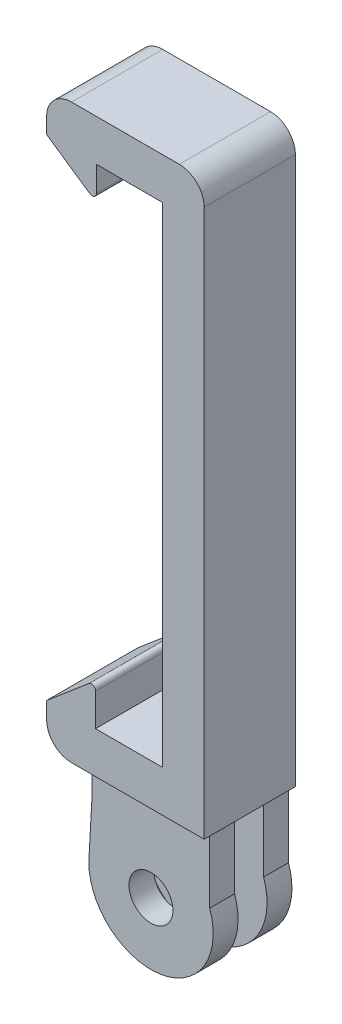
ISO-10303-21;
HEADER;
FILE_DESCRIPTION(('STEP AP214'),'2;1');
FILE_NAME('part.step','',(''),(''),'','','');
FILE_SCHEMA(('AUTOMOTIVE_DESIGN { 1 0 10303 214 1 1 1 1 }'));
ENDSEC;
DATA;
#1=APPLICATION_CONTEXT('core data for automotive mechanical design processes');
#2=APPLICATION_PROTOCOL_DEFINITION('international standard','automotive_design',2000,#1);
#3=PRODUCT_CONTEXT('',#1,'mechanical');
#4=PRODUCT('Part','Part','',(#3));
#5=PRODUCT_RELATED_PRODUCT_CATEGORY('part','',(#4));
#6=PRODUCT_DEFINITION_FORMATION('','',#4);
#7=PRODUCT_DEFINITION_CONTEXT('part definition',#1,'design');
#8=PRODUCT_DEFINITION('design','',#6,#7);
#9=PRODUCT_DEFINITION_SHAPE('','',#8);
#10=(LENGTH_UNIT() NAMED_UNIT(*) SI_UNIT(.MILLI.,.METRE.));
#11=(NAMED_UNIT(*) PLANE_ANGLE_UNIT() SI_UNIT($,.RADIAN.));
#12=(NAMED_UNIT(*) SI_UNIT($,.STERADIAN.) SOLID_ANGLE_UNIT());
#13=UNCERTAINTY_MEASURE_WITH_UNIT(LENGTH_MEASURE(1.E-05),#10,'distance_accuracy_value','');
#14=(GEOMETRIC_REPRESENTATION_CONTEXT(3) GLOBAL_UNCERTAINTY_ASSIGNED_CONTEXT((#13)) GLOBAL_UNIT_ASSIGNED_CONTEXT((#10,
#11,#12)) REPRESENTATION_CONTEXT('',''));
#15=CARTESIAN_POINT('',(0.,0.,0.));
#16=DIRECTION('',(0.,0.,1.));
#17=DIRECTION('',(1.,0.,0.));
#18=AXIS2_PLACEMENT_3D('',#15,#16,#17);
#19=CARTESIAN_POINT('',(-7.08446354913658,0.,11.));
#20=DIRECTION('',(1.,0.,0.));
#21=DIRECTION('',(0.,0.,-1.));
#22=AXIS2_PLACEMENT_3D('',#19,#20,#21);
#23=PLANE('',#22);
#24=DIRECTION('',(0.,-1.,0.));
#25=VECTOR('',#24,1.);
#26=CARTESIAN_POINT('',(-7.08446354913658,0.,9.49999999999999));
#27=LINE('',#26,#25);
#28=CARTESIAN_POINT('',(-7.08446354913658,18.,9.49999999999999));
#29=VERTEX_POINT('',#28);
#30=CARTESIAN_POINT('',(-7.08446354913658,14.6794442883254,9.49999999999999));
#31=VERTEX_POINT('',#30);
#32=EDGE_CURVE('E218',#29,#31,#27,.T.);
#33=ORIENTED_EDGE('',*,*,#32,.F.);
#34=DIRECTION('',(0.,0.,-1.));
#35=VECTOR('',#34,1.);
#36=CARTESIAN_POINT('',(-7.08446354913658,18.,11.));
#37=LINE('',#36,#35);
#38=CARTESIAN_POINT('',(-7.08446354913658,18.,6.5));
#39=VERTEX_POINT('',#38);
#40=EDGE_CURVE('E230',#29,#39,#37,.T.);
#41=ORIENTED_EDGE('',*,*,#40,.T.);
#42=DIRECTION('',(0.,-1.,0.));
#43=VECTOR('',#42,1.);
#44=CARTESIAN_POINT('',(-7.08446354913658,0.,6.5));
#45=LINE('',#44,#43);
#46=CARTESIAN_POINT('',(-7.08446354913658,14.6794442883254,6.5));
#47=VERTEX_POINT('',#46);
#48=EDGE_CURVE('E327',#39,#47,#45,.T.);
#49=ORIENTED_EDGE('',*,*,#48,.T.);
#50=DIRECTION('',(0.,0.,-1.));
#51=VECTOR('',#50,1.);
#52=CARTESIAN_POINT('',(-7.08446354913658,14.6794442883254,11.));
#53=LINE('',#52,#51);
#54=EDGE_CURVE('E232',#31,#47,#53,.T.);
#55=ORIENTED_EDGE('',*,*,#54,.F.);
#56=EDGE_LOOP('',(#33,#41,#49,#55));
#57=FACE_BOUND('',#56,.T.);
#58=ADVANCED_FACE('F37',(#57),#23,.F.);
#59=CARTESIAN_POINT('',(-7.87360650821918,0.436236067189407,11.));
#60=DIRECTION('',(0.998468675366061,-0.0553200172879889,0.));
#61=DIRECTION('',(0.0553200172879889,0.998468675366061,0.));
#62=AXIS2_PLACEMENT_3D('',#59,#60,#61);
#63=PLANE('',#62);
#64=DIRECTION('',(-0.0553200172879889,-0.998468675366061,0.));
#65=VECTOR('',#64,1.);
#66=CARTESIAN_POINT('',(-7.87360650821918,0.436236067189407,9.49999999999999));
#67=LINE('',#66,#65);
#68=CARTESIAN_POINT('',(-7.5,7.17944428832535,9.49999999999999));
#69=VERTEX_POINT('',#68);
#70=EDGE_CURVE('E234',#31,#69,#67,.T.);
#71=ORIENTED_EDGE('',*,*,#70,.F.);
#72=ORIENTED_EDGE('',*,*,#54,.T.);
#73=DIRECTION('',(-0.0553200172879889,-0.998468675366061,0.));
#74=VECTOR('',#73,1.);
#75=CARTESIAN_POINT('',(-7.87360650821918,0.436236067189407,6.5));
#76=LINE('',#75,#74);
#77=CARTESIAN_POINT('',(-7.5,7.17944428832535,6.5));
#78=VERTEX_POINT('',#77);
#79=EDGE_CURVE('E426',#47,#78,#76,.T.);
#80=ORIENTED_EDGE('',*,*,#79,.T.);
#81=DIRECTION('',(0.,0.,-1.));
#82=VECTOR('',#81,1.);
#83=CARTESIAN_POINT('',(-7.5,7.17944428832535,11.));
#84=LINE('',#83,#82);
#85=EDGE_CURVE('E384',#69,#78,#84,.T.);
#86=ORIENTED_EDGE('',*,*,#85,.F.);
#87=EDGE_LOOP('',(#71,#72,#80,#86));
#88=FACE_BOUND('',#87,.T.);
#89=ADVANCED_FACE('F475',(#88),#63,.F.);
#90=CARTESIAN_POINT('',(0.,7.17944428832535,11.));
#91=DIRECTION('',(0.,0.,-1.));
#92=DIRECTION('',(-1.,0.,0.));
#93=AXIS2_PLACEMENT_3D('',#90,#91,#92);
#94=CYLINDRICAL_SURFACE('',#93,7.5);
#95=CARTESIAN_POINT('',(0.,7.17944428832535,9.49999999999999));
#96=DIRECTION('',(0.,0.,1.));
#97=DIRECTION('',(1.,0.,0.));
#98=AXIS2_PLACEMENT_3D('',#95,#96,#97);
#99=CIRCLE('',#98,7.5);
#100=CARTESIAN_POINT('',(7.0844635491365,9.64122742681566,9.49999999999999));
#101=VERTEX_POINT('',#100);
#102=EDGE_CURVE('E898',#69,#101,#99,.T.);
#103=ORIENTED_EDGE('',*,*,#102,.F.);
#104=ORIENTED_EDGE('',*,*,#85,.T.);
#105=CARTESIAN_POINT('',(0.,7.17944428832535,6.5));
#106=DIRECTION('',(0.,0.,1.));
#107=DIRECTION('',(1.,0.,0.));
#108=AXIS2_PLACEMENT_3D('',#105,#106,#107);
#109=CIRCLE('',#108,7.5);
#110=CARTESIAN_POINT('',(7.0844635491365,9.64122742681566,6.5));
#111=VERTEX_POINT('',#110);
#112=EDGE_CURVE('E424',#78,#111,#109,.T.);
#113=ORIENTED_EDGE('',*,*,#112,.T.);
#114=DIRECTION('',(0.,0.,-1.));
#115=VECTOR('',#114,1.);
#116=CARTESIAN_POINT('',(7.08446354913658,9.64122742681566,11.));
#117=LINE('',#116,#115);
#118=EDGE_CURVE('E382',#101,#111,#117,.T.);
#119=ORIENTED_EDGE('',*,*,#118,.F.);
#120=EDGE_LOOP('',(#103,#104,#113,#119));
#121=FACE_BOUND('',#120,.T.);
#122=ADVANCED_FACE('F481',(#121),#94,.T.);
#123=CARTESIAN_POINT('',(7.0844635491363,-1.49170031818995E-13,11.));
#124=DIRECTION('',(1.,0.,0.));
#125=DIRECTION('',(0.,1.,0.));
#126=AXIS2_PLACEMENT_3D('',#123,#124,#125);
#127=PLANE('',#126);
#128=DIRECTION('',(0.,0.,-1.));
#129=VECTOR('',#128,1.);
#130=CARTESIAN_POINT('',(7.08446354913663,18.,11.));
#131=LINE('',#130,#129);
#132=CARTESIAN_POINT('',(7.08446354913663,18.,9.49999999999999));
#133=VERTEX_POINT('',#132);
#134=CARTESIAN_POINT('',(7.08446354913663,18.,6.5));
#135=VERTEX_POINT('',#134);
#136=EDGE_CURVE('E379',#133,#135,#131,.T.);
#137=ORIENTED_EDGE('',*,*,#136,.F.);
#138=DIRECTION('',(0.,-1.,0.));
#139=VECTOR('',#138,1.);
#140=CARTESIAN_POINT('',(7.0844635491363,-1.49170031818995E-13,9.49999999999999));
#141=LINE('',#140,#139);
#142=EDGE_CURVE('E221',#133,#101,#141,.T.);
#143=ORIENTED_EDGE('',*,*,#142,.T.);
#144=ORIENTED_EDGE('',*,*,#118,.T.);
#145=DIRECTION('',(0.,-1.,0.));
#146=VECTOR('',#145,1.);
#147=CARTESIAN_POINT('',(7.0844635491363,-1.49170031818995E-13,6.5));
#148=LINE('',#147,#146);
#149=EDGE_CURVE('E265',#135,#111,#148,.T.);
#150=ORIENTED_EDGE('',*,*,#149,.F.);
#151=EDGE_LOOP('',(#137,#143,#144,#150));
#152=FACE_BOUND('',#151,.T.);
#153=ADVANCED_FACE('F620',(#152),#127,.T.);
#154=CARTESIAN_POINT('',(0.,7.17944428832535,11.));
#155=DIRECTION('',(0.,0.,-1.));
#156=DIRECTION('',(-1.,0.,0.));
#157=AXIS2_PLACEMENT_3D('',#154,#155,#156);
#158=CYLINDRICAL_SURFACE('',#157,2.65);
#159=CARTESIAN_POINT('',(0.,7.17944428832535,6.5));
#160=DIRECTION('',(0.,0.,1.));
#161=DIRECTION('',(1.,0.,0.));
#162=AXIS2_PLACEMENT_3D('',#159,#160,#161);
#163=CIRCLE('',#162,2.65);
#164=CARTESIAN_POINT('',(2.65,7.17944428832535,6.5));
#165=VERTEX_POINT('',#164);
#166=EDGE_CURVE('E262',#165,#165,#163,.T.);
#167=ORIENTED_EDGE('',*,*,#166,.F.);
#168=EDGE_LOOP('',(#167));
#169=FACE_BOUND('',#168,.T.);
#170=CARTESIAN_POINT('',(0.,7.17944428832535,9.49999999999999));
#171=DIRECTION('',(0.,0.,1.));
#172=DIRECTION('',(1.,0.,0.));
#173=AXIS2_PLACEMENT_3D('',#170,#171,#172);
#174=CIRCLE('',#173,2.65);
#175=CARTESIAN_POINT('',(2.65,7.17944428832535,9.49999999999999));
#176=VERTEX_POINT('',#175);
#177=EDGE_CURVE('E225',#176,#176,#174,.T.);
#178=ORIENTED_EDGE('',*,*,#177,.T.);
#179=EDGE_LOOP('',(#178));
#180=FACE_BOUND('',#179,.T.);
#181=ADVANCED_FACE('F491',(#169,#180),#158,.F.);
#182=CARTESIAN_POINT('',(0.,0.,11.));
#183=DIRECTION('',(0.,0.,1.));
#184=DIRECTION('',(1.,0.,0.));
#185=AXIS2_PLACEMENT_3D('',#182,#183,#184);
#186=PLANE('',#185);
#187=DIRECTION('',(0.,1.,0.));
#188=VECTOR('',#187,1.);
#189=CARTESIAN_POINT('',(-5.18446354913658,0.,11.));
#190=LINE('',#189,#188);
#191=CARTESIAN_POINT('',(-5.18446354913658,23.,11.));
#192=VERTEX_POINT('',#191);
#193=CARTESIAN_POINT('',(-5.18446354913658,26.9208735152208,11.));
#194=VERTEX_POINT('',#193);
#195=EDGE_CURVE('E441',#192,#194,#190,.T.);
#196=ORIENTED_EDGE('',*,*,#195,.T.);
#197=CARTESIAN_POINT('',(-5.68446354913658,26.9208735152208,11.));
#198=DIRECTION('',(0.,0.,1.));
#199=DIRECTION('',(1.,0.,0.));
#200=AXIS2_PLACEMENT_3D('',#197,#198,#199);
#201=CIRCLE('',#200,0.5);
#202=CARTESIAN_POINT('',(-6.00772439683738,27.3023213155078,11.));
#203=VERTEX_POINT('',#202);
#204=EDGE_CURVE('E305',#194,#203,#201,.T.);
#205=ORIENTED_EDGE('',*,*,#204,.T.);
#206=DIRECTION('',(-0.762895600573906,-0.646521695401616,0.));
#207=VECTOR('',#206,1.);
#208=CARTESIAN_POINT('',(-15.9774550865811,18.8533970021657,11.));
#209=LINE('',#208,#207);
#210=CARTESIAN_POINT('',(-11.0844635491366,23.,11.));
#211=VERTEX_POINT('',#210);
#212=EDGE_CURVE('E444',#203,#211,#209,.T.);
#213=ORIENTED_EDGE('',*,*,#212,.T.);
#214=DIRECTION('',(0.,-1.,0.));
#215=VECTOR('',#214,1.);
#216=CARTESIAN_POINT('',(-11.0844635491366,0.,11.));
#217=LINE('',#216,#215);
#218=CARTESIAN_POINT('',(-11.0844635491366,21.,11.));
#219=VERTEX_POINT('',#218);
#220=EDGE_CURVE('E446',#211,#219,#217,.T.);
#221=ORIENTED_EDGE('',*,*,#220,.T.);
#222=CARTESIAN_POINT('',(-8.08446354913658,21.,11.));
#223=DIRECTION('',(0.,0.,1.));
#224=DIRECTION('',(1.,0.,0.));
#225=AXIS2_PLACEMENT_3D('',#222,#223,#224);
#226=CIRCLE('',#225,3.);
#227=CARTESIAN_POINT('',(-8.08446354913658,18.,11.));
#228=VERTEX_POINT('',#227);
#229=EDGE_CURVE('E284',#219,#228,#226,.T.);
#230=ORIENTED_EDGE('',*,*,#229,.T.);
#231=DIRECTION('',(-1.,0.,0.));
#232=VECTOR('',#231,1.);
#233=CARTESIAN_POINT('',(0.,18.,11.));
#234=LINE('',#233,#232);
#235=CARTESIAN_POINT('',(7.91553645086342,18.,11.));
#236=VERTEX_POINT('',#235);
#237=EDGE_CURVE('E449',#236,#228,#234,.T.);
#238=ORIENTED_EDGE('',*,*,#237,.F.);
#239=DIRECTION('',(0.,1.,0.));
#240=VECTOR('',#239,1.);
#241=CARTESIAN_POINT('',(7.91553645086342,0.,11.));
#242=LINE('',#241,#240);
#243=CARTESIAN_POINT('',(7.91553645086342,84.,11.));
#244=VERTEX_POINT('',#243);
#245=EDGE_CURVE('E452',#236,#244,#242,.T.);
#246=ORIENTED_EDGE('',*,*,#245,.T.);
#247=CARTESIAN_POINT('',(4.91553645086342,84.,11.));
#248=DIRECTION('',(0.,0.,1.));
#249=DIRECTION('',(1.,0.,0.));
#250=AXIS2_PLACEMENT_3D('',#247,#248,#249);
#251=CIRCLE('',#250,3.);
#252=CARTESIAN_POINT('',(4.91553645086342,87.,11.));
#253=VERTEX_POINT('',#252);
#254=EDGE_CURVE('E282',#244,#253,#251,.T.);
#255=ORIENTED_EDGE('',*,*,#254,.T.);
#256=DIRECTION('',(-1.,0.,0.));
#257=VECTOR('',#256,1.);
#258=CARTESIAN_POINT('',(0.,87.,11.));
#259=LINE('',#258,#257);
#260=CARTESIAN_POINT('',(-8.08446354913658,87.,11.));
#261=VERTEX_POINT('',#260);
#262=EDGE_CURVE('E455',#253,#261,#259,.T.);
#263=ORIENTED_EDGE('',*,*,#262,.T.);
#264=CARTESIAN_POINT('',(-8.08446354913658,84.,11.));
#265=DIRECTION('',(0.,0.,1.));
#266=DIRECTION('',(1.,0.,0.));
#267=AXIS2_PLACEMENT_3D('',#264,#265,#266);
#268=CIRCLE('',#267,3.);
#269=CARTESIAN_POINT('',(-11.0844635491366,84.,11.));
#270=VERTEX_POINT('',#269);
#271=EDGE_CURVE('E286',#261,#270,#268,.T.);
#272=ORIENTED_EDGE('',*,*,#271,.T.);
#273=DIRECTION('',(0.,-1.,0.));
#274=VECTOR('',#273,1.);
#275=CARTESIAN_POINT('',(-11.0844635491366,0.,11.));
#276=LINE('',#275,#274);
#277=CARTESIAN_POINT('',(-11.0844635491366,82.1053579217232,11.));
#278=VERTEX_POINT('',#277);
#279=EDGE_CURVE('E376',#270,#278,#276,.T.);
#280=ORIENTED_EDGE('',*,*,#279,.T.);
#281=DIRECTION('',(-0.825301186501159,0.564692793968348,0.));
#282=VECTOR('',#281,1.);
#283=CARTESIAN_POINT('',(34.7299240425881,50.7579480836259,11.));
#284=LINE('',#283,#282);
#285=CARTESIAN_POINT('',(-5.86680994612077,78.5353019963984,11.));
#286=VERTEX_POINT('',#285);
#287=EDGE_CURVE('E371',#286,#278,#284,.T.);
#288=ORIENTED_EDGE('',*,*,#287,.F.);
#289=CARTESIAN_POINT('',(-5.58446354913658,78.947952589649,11.));
#290=DIRECTION('',(0.,0.,1.));
#291=DIRECTION('',(1.,0.,0.));
#292=AXIS2_PLACEMENT_3D('',#289,#290,#291);
#293=CIRCLE('',#292,0.5);
#294=CARTESIAN_POINT('',(-5.08446354913658,78.947952589649,11.));
#295=VERTEX_POINT('',#294);
#296=EDGE_CURVE('E52',#286,#295,#293,.T.);
#297=ORIENTED_EDGE('',*,*,#296,.T.);
#298=DIRECTION('',(0.,-1.,0.));
#299=VECTOR('',#298,1.);
#300=CARTESIAN_POINT('',(-5.08446354913658,0.,11.));
#301=LINE('',#300,#299);
#302=CARTESIAN_POINT('',(-5.08446354913658,82.,11.));
#303=VERTEX_POINT('',#302);
#304=EDGE_CURVE('E314',#303,#295,#301,.T.);
#305=ORIENTED_EDGE('',*,*,#304,.F.);
#306=DIRECTION('',(-1.,0.,0.));
#307=VECTOR('',#306,1.);
#308=CARTESIAN_POINT('',(0.,82.,11.));
#309=LINE('',#308,#307);
#310=CARTESIAN_POINT('',(2.91553645086342,82.,11.));
#311=VERTEX_POINT('',#310);
#312=EDGE_CURVE('E432',#311,#303,#309,.T.);
#313=ORIENTED_EDGE('',*,*,#312,.F.);
#314=DIRECTION('',(0.,1.,0.));
#315=VECTOR('',#314,1.);
#316=CARTESIAN_POINT('',(2.91553645086342,0.,11.));
#317=LINE('',#316,#315);
#318=CARTESIAN_POINT('',(2.91553645086342,23.,11.));
#319=VERTEX_POINT('',#318);
#320=EDGE_CURVE('E435',#319,#311,#317,.T.);
#321=ORIENTED_EDGE('',*,*,#320,.F.);
#322=DIRECTION('',(1.,0.,0.));
#323=VECTOR('',#322,1.);
#324=CARTESIAN_POINT('',(0.,23.,11.));
#325=LINE('',#324,#323);
#326=EDGE_CURVE('E438',#192,#319,#325,.T.);
#327=ORIENTED_EDGE('',*,*,#326,.F.);
#328=EDGE_LOOP('',(#196,#205,#213,#221,#230,#238,#246,#255,#263,#272,#280,#288,#297,#305,#313,
#321,#327));
#329=FACE_BOUND('',#328,.T.);
#330=ADVANCED_FACE('F460',(#329),#186,.T.);
#331=DIRECTION('',(0.,-1.,0.));
#332=VECTOR('',#331,1.);
#333=CARTESIAN_POINT('',(-7.08446354913658,0.,3.));
#334=LINE('',#333,#332);
#335=CARTESIAN_POINT('',(-7.08446354913658,18.,3.));
#336=VERTEX_POINT('',#335);
#337=CARTESIAN_POINT('',(-7.08446354913658,14.6794442883254,3.));
#338=VERTEX_POINT('',#337);
#339=EDGE_CURVE('E266',#336,#338,#334,.T.);
#340=ORIENTED_EDGE('',*,*,#339,.F.);
#341=CARTESIAN_POINT('',(-7.08446354913658,18.,0.));
#342=VERTEX_POINT('',#341);
#343=EDGE_CURVE('E242',#336,#342,#37,.T.);
#344=ORIENTED_EDGE('',*,*,#343,.T.);
#345=DIRECTION('',(0.,-1.,0.));
#346=VECTOR('',#345,1.);
#347=CARTESIAN_POINT('',(-7.08446354913658,0.,0.));
#348=LINE('',#347,#346);
#349=CARTESIAN_POINT('',(-7.08446354913658,14.6794442883254,0.));
#350=VERTEX_POINT('',#349);
#351=EDGE_CURVE('E346',#342,#350,#348,.T.);
#352=ORIENTED_EDGE('',*,*,#351,.T.);
#353=EDGE_CURVE('E385',#338,#350,#53,.T.);
#354=ORIENTED_EDGE('',*,*,#353,.F.);
#355=EDGE_LOOP('',(#340,#344,#352,#354));
#356=FACE_BOUND('',#355,.T.);
#357=ADVANCED_FACE('F477',(#356),#23,.F.);
#358=DIRECTION('',(-0.0553200172879889,-0.998468675366061,0.));
#359=VECTOR('',#358,1.);
#360=CARTESIAN_POINT('',(-7.87360650821918,0.436236067189407,3.));
#361=LINE('',#360,#359);
#362=CARTESIAN_POINT('',(-7.5,7.17944428832535,3.));
#363=VERTEX_POINT('',#362);
#364=EDGE_CURVE('E415',#338,#363,#361,.T.);
#365=ORIENTED_EDGE('',*,*,#364,.F.);
#366=ORIENTED_EDGE('',*,*,#353,.T.);
#367=DIRECTION('',(-0.0553200172879889,-0.998468675366061,0.));
#368=VECTOR('',#367,1.);
#369=CARTESIAN_POINT('',(-7.87360650821918,0.436236067189407,0.));
#370=LINE('',#369,#368);
#371=CARTESIAN_POINT('',(-7.5,7.17944428832535,0.));
#372=VERTEX_POINT('',#371);
#373=EDGE_CURVE('E350',#350,#372,#370,.T.);
#374=ORIENTED_EDGE('',*,*,#373,.T.);
#375=EDGE_CURVE('E383',#363,#372,#84,.T.);
#376=ORIENTED_EDGE('',*,*,#375,.F.);
#377=EDGE_LOOP('',(#365,#366,#374,#376));
#378=FACE_BOUND('',#377,.T.);
#379=ADVANCED_FACE('F401',(#378),#63,.F.);
#380=CARTESIAN_POINT('',(0.,7.17944428832535,3.));
#381=DIRECTION('',(0.,0.,1.));
#382=DIRECTION('',(1.,0.,0.));
#383=AXIS2_PLACEMENT_3D('',#380,#381,#382);
#384=CIRCLE('',#383,7.5);
#385=CARTESIAN_POINT('',(7.08446354913658,9.64122742681566,3.));
#386=VERTEX_POINT('',#385);
#387=EDGE_CURVE('E397',#363,#386,#384,.T.);
#388=ORIENTED_EDGE('',*,*,#387,.F.);
#389=ORIENTED_EDGE('',*,*,#375,.T.);
#390=CARTESIAN_POINT('',(0.,7.17944428832535,0.));
#391=DIRECTION('',(0.,0.,1.));
#392=DIRECTION('',(1.,0.,0.));
#393=AXIS2_PLACEMENT_3D('',#390,#391,#392);
#394=CIRCLE('',#393,7.5);
#395=CARTESIAN_POINT('',(7.08446354913658,9.64122742681566,0.));
#396=VERTEX_POINT('',#395);
#397=EDGE_CURVE('E353',#372,#396,#394,.T.);
#398=ORIENTED_EDGE('',*,*,#397,.T.);
#399=EDGE_CURVE('E381',#386,#396,#117,.T.);
#400=ORIENTED_EDGE('',*,*,#399,.F.);
#401=EDGE_LOOP('',(#388,#389,#398,#400));
#402=FACE_BOUND('',#401,.T.);
#403=ADVANCED_FACE('F394',(#402),#94,.T.);
#404=CARTESIAN_POINT('',(7.08446354913663,18.,3.));
#405=VERTEX_POINT('',#404);
#406=CARTESIAN_POINT('',(7.08446354913663,18.,0.));
#407=VERTEX_POINT('',#406);
#408=EDGE_CURVE('E378',#405,#407,#131,.T.);
#409=ORIENTED_EDGE('',*,*,#408,.F.);
#410=DIRECTION('',(0.,-1.,0.));
#411=VECTOR('',#410,1.);
#412=CARTESIAN_POINT('',(7.0844635491363,-1.49170031818995E-13,3.));
#413=LINE('',#412,#411);
#414=EDGE_CURVE('E261',#405,#386,#413,.T.);
#415=ORIENTED_EDGE('',*,*,#414,.T.);
#416=ORIENTED_EDGE('',*,*,#399,.T.);
#417=DIRECTION('',(0.,-1.,0.));
#418=VECTOR('',#417,1.);
#419=CARTESIAN_POINT('',(7.0844635491363,-1.49170031818995E-13,0.));
#420=LINE('',#419,#418);
#421=EDGE_CURVE('E356',#407,#396,#420,.T.);
#422=ORIENTED_EDGE('',*,*,#421,.F.);
#423=EDGE_LOOP('',(#409,#415,#416,#422));
#424=FACE_BOUND('',#423,.T.);
#425=ADVANCED_FACE('F410',(#424),#127,.T.);
#426=CARTESIAN_POINT('',(0.,7.17944428832535,0.));
#427=DIRECTION('',(0.,0.,1.));
#428=DIRECTION('',(1.,0.,0.));
#429=AXIS2_PLACEMENT_3D('',#426,#427,#428);
#430=CIRCLE('',#429,2.65);
#431=CARTESIAN_POINT('',(2.65,7.17944428832535,0.));
#432=VERTEX_POINT('',#431);
#433=EDGE_CURVE('E368',#432,#432,#430,.T.);
#434=ORIENTED_EDGE('',*,*,#433,.F.);
#435=EDGE_LOOP('',(#434));
#436=FACE_BOUND('',#435,.T.);
#437=CARTESIAN_POINT('',(0.,7.17944428832535,3.));
#438=DIRECTION('',(0.,0.,1.));
#439=DIRECTION('',(1.,0.,0.));
#440=AXIS2_PLACEMENT_3D('',#437,#438,#439);
#441=CIRCLE('',#440,2.65);
#442=CARTESIAN_POINT('',(2.65,7.17944428832535,3.));
#443=VERTEX_POINT('',#442);
#444=EDGE_CURVE('E258',#443,#443,#441,.T.);
#445=ORIENTED_EDGE('',*,*,#444,.T.);
#446=EDGE_LOOP('',(#445));
#447=FACE_BOUND('',#446,.T.);
#448=ADVANCED_FACE('F604',(#436,#447),#158,.F.);
#449=CARTESIAN_POINT('',(34.7299240425881,50.7579480836259,11.));
#450=DIRECTION('',(-0.564692793968348,-0.825301186501159,0.));
#451=DIRECTION('',(0.825301186501159,-0.564692793968348,0.));
#452=AXIS2_PLACEMENT_3D('',#449,#450,#451);
#453=PLANE('',#452);
#454=DIRECTION('',(-0.825301186501159,0.564692793968348,0.));
#455=VECTOR('',#454,1.);
#456=CARTESIAN_POINT('',(34.7299240425881,50.7579480836259,0.));
#457=LINE('',#456,#455);
#458=CARTESIAN_POINT('',(-5.86680994612077,78.5353019963984,0.));
#459=VERTEX_POINT('',#458);
#460=CARTESIAN_POINT('',(-11.0844635491366,82.1053579217232,0.));
#461=VERTEX_POINT('',#460);
#462=EDGE_CURVE('E323',#459,#461,#457,.T.);
#463=ORIENTED_EDGE('',*,*,#462,.F.);
#464=DIRECTION('',(0.,0.,-1.));
#465=VECTOR('',#464,1.);
#466=CARTESIAN_POINT('',(-5.86680994612076,78.5353019963984,11.));
#467=LINE('',#466,#465);
#468=EDGE_CURVE('E11',#459,#286,#467,.F.);
#469=ORIENTED_EDGE('',*,*,#468,.T.);
#470=ORIENTED_EDGE('',*,*,#287,.T.);
#471=DIRECTION('',(0.,0.,-1.));
#472=VECTOR('',#471,1.);
#473=CARTESIAN_POINT('',(-11.0844635491366,82.1053579217232,11.));
#474=LINE('',#473,#472);
#475=EDGE_CURVE('E372',#278,#461,#474,.T.);
#476=ORIENTED_EDGE('',*,*,#475,.T.);
#477=EDGE_LOOP('',(#463,#469,#470,#476));
#478=FACE_BOUND('',#477,.T.);
#479=ADVANCED_FACE('F466',(#478),#453,.T.);
#480=CARTESIAN_POINT('',(-5.08446354913658,0.,11.));
#481=DIRECTION('',(1.,0.,0.));
#482=DIRECTION('',(0.,0.,-1.));
#483=AXIS2_PLACEMENT_3D('',#480,#481,#482);
#484=PLANE('',#483);
#485=ORIENTED_EDGE('',*,*,#304,.T.);
#486=DIRECTION('',(0.,0.,-1.));
#487=VECTOR('',#486,1.);
#488=CARTESIAN_POINT('',(-5.08446354913658,78.947952589649,11.));
#489=LINE('',#488,#487);
#490=CARTESIAN_POINT('',(-5.08446354913658,78.947952589649,0.));
#491=VERTEX_POINT('',#490);
#492=EDGE_CURVE('E45',#295,#491,#489,.T.);
#493=ORIENTED_EDGE('',*,*,#492,.T.);
#494=DIRECTION('',(0.,-1.,0.));
#495=VECTOR('',#494,1.);
#496=CARTESIAN_POINT('',(-5.08446354913658,0.,0.));
#497=LINE('',#496,#495);
#498=CARTESIAN_POINT('',(-5.08446354913658,82.,0.));
#499=VERTEX_POINT('',#498);
#500=EDGE_CURVE('E312',#499,#491,#497,.T.);
#501=ORIENTED_EDGE('',*,*,#500,.F.);
#502=DIRECTION('',(0.,0.,-1.));
#503=VECTOR('',#502,1.);
#504=CARTESIAN_POINT('',(-5.08446354913658,82.,11.));
#505=LINE('',#504,#503);
#506=EDGE_CURVE('E255',#303,#499,#505,.T.);
#507=ORIENTED_EDGE('',*,*,#506,.F.);
#508=EDGE_LOOP('',(#485,#493,#501,#507));
#509=FACE_BOUND('',#508,.T.);
#510=ADVANCED_FACE('F311',(#509),#484,.T.);
#511=CARTESIAN_POINT('',(0.,82.,11.));
#512=DIRECTION('',(0.,-1.,0.));
#513=DIRECTION('',(0.,0.,-1.));
#514=AXIS2_PLACEMENT_3D('',#511,#512,#513);
#515=PLANE('',#514);
#516=DIRECTION('',(-1.,0.,0.));
#517=VECTOR('',#516,1.);
#518=CARTESIAN_POINT('',(0.,82.,0.));
#519=LINE('',#518,#517);
#520=CARTESIAN_POINT('',(2.91553645086342,82.,0.));
#521=VERTEX_POINT('',#520);
#522=EDGE_CURVE('E322',#521,#499,#519,.T.);
#523=ORIENTED_EDGE('',*,*,#522,.F.);
#524=DIRECTION('',(0.,0.,-1.));
#525=VECTOR('',#524,1.);
#526=CARTESIAN_POINT('',(2.91553645086342,82.,11.));
#527=LINE('',#526,#525);
#528=EDGE_CURVE('E253',#311,#521,#527,.T.);
#529=ORIENTED_EDGE('',*,*,#528,.F.);
#530=ORIENTED_EDGE('',*,*,#312,.T.);
#531=ORIENTED_EDGE('',*,*,#506,.T.);
#532=EDGE_LOOP('',(#523,#529,#530,#531));
#533=FACE_BOUND('',#532,.T.);
#534=ADVANCED_FACE('F595',(#533),#515,.T.);
#535=CARTESIAN_POINT('',(2.91553645086342,0.,11.));
#536=DIRECTION('',(-1.,0.,0.));
#537=DIRECTION('',(0.,0.,1.));
#538=AXIS2_PLACEMENT_3D('',#535,#536,#537);
#539=PLANE('',#538);
#540=DIRECTION('',(0.,1.,0.));
#541=VECTOR('',#540,1.);
#542=CARTESIAN_POINT('',(2.91553645086342,0.,0.));
#543=LINE('',#542,#541);
#544=CARTESIAN_POINT('',(2.91553645086342,23.,0.));
#545=VERTEX_POINT('',#544);
#546=EDGE_CURVE('E325',#545,#521,#543,.T.);
#547=ORIENTED_EDGE('',*,*,#546,.F.);
#548=DIRECTION('',(0.,0.,-1.));
#549=VECTOR('',#548,1.);
#550=CARTESIAN_POINT('',(2.91553645086342,23.,11.));
#551=LINE('',#550,#549);
#552=EDGE_CURVE('E251',#319,#545,#551,.T.);
#553=ORIENTED_EDGE('',*,*,#552,.F.);
#554=ORIENTED_EDGE('',*,*,#320,.T.);
#555=ORIENTED_EDGE('',*,*,#528,.T.);
#556=EDGE_LOOP('',(#547,#553,#554,#555));
#557=FACE_BOUND('',#556,.T.);
#558=ADVANCED_FACE('F651',(#557),#539,.T.);
#559=CARTESIAN_POINT('',(0.,23.,11.));
#560=DIRECTION('',(0.,1.,0.));
#561=DIRECTION('',(0.,0.,1.));
#562=AXIS2_PLACEMENT_3D('',#559,#560,#561);
#563=PLANE('',#562);
#564=DIRECTION('',(1.,0.,0.));
#565=VECTOR('',#564,1.);
#566=CARTESIAN_POINT('',(0.,23.,0.));
#567=LINE('',#566,#565);
#568=CARTESIAN_POINT('',(-5.18446354913658,23.,0.));
#569=VERTEX_POINT('',#568);
#570=EDGE_CURVE('E332',#569,#545,#567,.T.);
#571=ORIENTED_EDGE('',*,*,#570,.F.);
#572=DIRECTION('',(0.,0.,-1.));
#573=VECTOR('',#572,1.);
#574=CARTESIAN_POINT('',(-5.18446354913658,23.,11.));
#575=LINE('',#574,#573);
#576=EDGE_CURVE('E245',#192,#569,#575,.T.);
#577=ORIENTED_EDGE('',*,*,#576,.F.);
#578=ORIENTED_EDGE('',*,*,#326,.T.);
#579=ORIENTED_EDGE('',*,*,#552,.T.);
#580=EDGE_LOOP('',(#571,#577,#578,#579));
#581=FACE_BOUND('',#580,.T.);
#582=ADVANCED_FACE('F583',(#581),#563,.T.);
#583=CARTESIAN_POINT('',(-5.18446354913658,0.,11.));
#584=DIRECTION('',(-1.,0.,0.));
#585=DIRECTION('',(0.,0.,1.));
#586=AXIS2_PLACEMENT_3D('',#583,#584,#585);
#587=PLANE('',#586);
#588=DIRECTION('',(0.,1.,0.));
#589=VECTOR('',#588,1.);
#590=CARTESIAN_POINT('',(-5.18446354913658,0.,0.));
#591=LINE('',#590,#589);
#592=CARTESIAN_POINT('',(-5.18446354913658,26.9208735152208,0.));
#593=VERTEX_POINT('',#592);
#594=EDGE_CURVE('E335',#569,#593,#591,.T.);
#595=ORIENTED_EDGE('',*,*,#594,.T.);
#596=DIRECTION('',(0.,0.,-1.));
#597=VECTOR('',#596,1.);
#598=CARTESIAN_POINT('',(-5.18446354913658,26.9208735152208,11.));
#599=LINE('',#598,#597);
#600=EDGE_CURVE('E302',#593,#194,#599,.F.);
#601=ORIENTED_EDGE('',*,*,#600,.T.);
#602=ORIENTED_EDGE('',*,*,#195,.F.);
#603=ORIENTED_EDGE('',*,*,#576,.T.);
#604=EDGE_LOOP('',(#595,#601,#602,#603));
#605=FACE_BOUND('',#604,.T.);
#606=ADVANCED_FACE('F571',(#605),#587,.F.);
#607=CARTESIAN_POINT('',(-15.9774550865811,18.8533970021657,11.));
#608=DIRECTION('',(0.646521695401616,-0.762895600573906,0.));
#609=DIRECTION('',(0.762895600573906,0.646521695401616,0.));
#610=AXIS2_PLACEMENT_3D('',#607,#608,#609);
#611=PLANE('',#610);
#612=ORIENTED_EDGE('',*,*,#212,.F.);
#613=DIRECTION('',(0.,0.,-1.));
#614=VECTOR('',#613,1.);
#615=CARTESIAN_POINT('',(-6.00772439683738,27.3023213155078,11.));
#616=LINE('',#615,#614);
#617=CARTESIAN_POINT('',(-6.00772439683738,27.3023213155078,0.));
#618=VERTEX_POINT('',#617);
#619=EDGE_CURVE('E295',#203,#618,#616,.T.);
#620=ORIENTED_EDGE('',*,*,#619,.T.);
#621=DIRECTION('',(-0.762895600573906,-0.646521695401616,0.));
#622=VECTOR('',#621,1.);
#623=CARTESIAN_POINT('',(-15.9774550865811,18.8533970021657,0.));
#624=LINE('',#623,#622);
#625=CARTESIAN_POINT('',(-11.0844635491366,23.,0.));
#626=VERTEX_POINT('',#625);
#627=EDGE_CURVE('E338',#618,#626,#624,.T.);
#628=ORIENTED_EDGE('',*,*,#627,.T.);
#629=DIRECTION('',(0.,0.,-1.));
#630=VECTOR('',#629,1.);
#631=CARTESIAN_POINT('',(-11.0844635491366,23.,11.));
#632=LINE('',#631,#630);
#633=EDGE_CURVE('E241',#211,#626,#632,.T.);
#634=ORIENTED_EDGE('',*,*,#633,.F.);
#635=EDGE_LOOP('',(#612,#620,#628,#634));
#636=FACE_BOUND('',#635,.T.);
#637=ADVANCED_FACE('F566',(#636),#611,.F.);
#638=CARTESIAN_POINT('',(-11.0844635491366,0.,11.));
#639=DIRECTION('',(1.,0.,0.));
#640=DIRECTION('',(0.,0.,-1.));
#641=AXIS2_PLACEMENT_3D('',#638,#639,#640);
#642=PLANE('',#641);
#643=DIRECTION('',(0.,-1.,0.));
#644=VECTOR('',#643,1.);
#645=CARTESIAN_POINT('',(-11.0844635491366,0.,0.));
#646=LINE('',#645,#644);
#647=CARTESIAN_POINT('',(-11.0844635491366,21.,0.));
#648=VERTEX_POINT('',#647);
#649=EDGE_CURVE('E340',#626,#648,#646,.T.);
#650=ORIENTED_EDGE('',*,*,#649,.T.);
#651=DIRECTION('',(0.,0.,-1.));
#652=VECTOR('',#651,1.);
#653=CARTESIAN_POINT('',(-11.0844635491366,21.,11.));
#654=LINE('',#653,#652);
#655=EDGE_CURVE('E291',#648,#219,#654,.F.);
#656=ORIENTED_EDGE('',*,*,#655,.T.);
#657=ORIENTED_EDGE('',*,*,#220,.F.);
#658=ORIENTED_EDGE('',*,*,#633,.T.);
#659=EDGE_LOOP('',(#650,#656,#657,#658));
#660=FACE_BOUND('',#659,.T.);
#661=ADVANCED_FACE('F501',(#660),#642,.F.);
#662=CARTESIAN_POINT('',(0.,18.,11.));
#663=DIRECTION('',(0.,-1.,0.));
#664=DIRECTION('',(0.,0.,-1.));
#665=AXIS2_PLACEMENT_3D('',#662,#663,#664);
#666=PLANE('',#665);
#667=ORIENTED_EDGE('',*,*,#40,.F.);
#668=DIRECTION('',(1.,0.,0.));
#669=VECTOR('',#668,1.);
#670=CARTESIAN_POINT('',(-11.0844635491366,18.,9.49999999999999));
#671=LINE('',#670,#669);
#672=EDGE_CURVE('E215',#29,#133,#671,.T.);
#673=ORIENTED_EDGE('',*,*,#672,.T.);
#674=ORIENTED_EDGE('',*,*,#136,.T.);
#675=DIRECTION('',(1.,0.,0.));
#676=VECTOR('',#675,1.);
#677=CARTESIAN_POINT('',(-11.0844635491366,18.,6.5));
#678=LINE('',#677,#676);
#679=EDGE_CURVE('E240',#39,#135,#678,.T.);
#680=ORIENTED_EDGE('',*,*,#679,.F.);
#681=EDGE_LOOP('',(#667,#673,#674,#680));
#682=FACE_BOUND('',#681,.T.);
#683=ORIENTED_EDGE('',*,*,#237,.T.);
#684=DIRECTION('',(0.,0.,-1.));
#685=VECTOR('',#684,1.);
#686=CARTESIAN_POINT('',(-8.08446354913658,18.,0.));
#687=LINE('',#686,#685);
#688=CARTESIAN_POINT('',(-8.08446354913658,18.,0.));
#689=VERTEX_POINT('',#688);
#690=EDGE_CURVE('E288',#228,#689,#687,.T.);
#691=ORIENTED_EDGE('',*,*,#690,.T.);
#692=DIRECTION('',(-1.,0.,0.));
#693=VECTOR('',#692,1.);
#694=CARTESIAN_POINT('',(0.,18.,0.));
#695=LINE('',#694,#693);
#696=EDGE_CURVE('E343',#342,#689,#695,.T.);
#697=ORIENTED_EDGE('',*,*,#696,.F.);
#698=ORIENTED_EDGE('',*,*,#343,.F.);
#699=DIRECTION('',(1.,0.,0.));
#700=VECTOR('',#699,1.);
#701=CARTESIAN_POINT('',(-11.0844635491366,18.,3.));
#702=LINE('',#701,#700);
#703=EDGE_CURVE('E233',#336,#405,#702,.T.);
#704=ORIENTED_EDGE('',*,*,#703,.T.);
#705=ORIENTED_EDGE('',*,*,#408,.T.);
#706=CARTESIAN_POINT('',(7.91553645086342,18.,0.));
#707=VERTEX_POINT('',#706);
#708=EDGE_CURVE('E347',#707,#407,#695,.T.);
#709=ORIENTED_EDGE('',*,*,#708,.F.);
#710=DIRECTION('',(0.,0.,-1.));
#711=VECTOR('',#710,1.);
#712=CARTESIAN_POINT('',(7.91553645086342,18.,11.));
#713=LINE('',#712,#711);
#714=EDGE_CURVE('E375',#236,#707,#713,.T.);
#715=ORIENTED_EDGE('',*,*,#714,.F.);
#716=EDGE_LOOP('',(#683,#691,#697,#698,#704,#705,#709,#715));
#717=FACE_BOUND('',#716,.T.);
#718=ADVANCED_FACE('F237',(#682,#717),#666,.T.);
#719=CARTESIAN_POINT('',(7.91553645086342,0.,11.));
#720=DIRECTION('',(-1.,0.,0.));
#721=DIRECTION('',(0.,0.,1.));
#722=AXIS2_PLACEMENT_3D('',#719,#720,#721);
#723=PLANE('',#722);
#724=DIRECTION('',(0.,1.,0.));
#725=VECTOR('',#724,1.);
#726=CARTESIAN_POINT('',(7.91553645086342,0.,0.));
#727=LINE('',#726,#725);
#728=CARTESIAN_POINT('',(7.91553645086342,84.,0.));
#729=VERTEX_POINT('',#728);
#730=EDGE_CURVE('E359',#707,#729,#727,.T.);
#731=ORIENTED_EDGE('',*,*,#730,.T.);
#732=DIRECTION('',(0.,0.,-1.));
#733=VECTOR('',#732,1.);
#734=CARTESIAN_POINT('',(7.91553645086342,84.,11.));
#735=LINE('',#734,#733);
#736=EDGE_CURVE('E293',#729,#244,#735,.F.);
#737=ORIENTED_EDGE('',*,*,#736,.T.);
#738=ORIENTED_EDGE('',*,*,#245,.F.);
#739=ORIENTED_EDGE('',*,*,#714,.T.);
#740=EDGE_LOOP('',(#731,#737,#738,#739));
#741=FACE_BOUND('',#740,.T.);
#742=ADVANCED_FACE('F509',(#741),#723,.F.);
#743=CARTESIAN_POINT('',(0.,87.,11.));
#744=DIRECTION('',(0.,-1.,0.));
#745=DIRECTION('',(0.,0.,-1.));
#746=AXIS2_PLACEMENT_3D('',#743,#744,#745);
#747=PLANE('',#746);
#748=DIRECTION('',(-1.,0.,0.));
#749=VECTOR('',#748,1.);
#750=CARTESIAN_POINT('',(0.,87.,0.));
#751=LINE('',#750,#749);
#752=CARTESIAN_POINT('',(4.91553645086342,87.,0.));
#753=VERTEX_POINT('',#752);
#754=CARTESIAN_POINT('',(-8.08446354913658,87.,0.));
#755=VERTEX_POINT('',#754);
#756=EDGE_CURVE('E362',#753,#755,#751,.T.);
#757=ORIENTED_EDGE('',*,*,#756,.T.);
#758=DIRECTION('',(0.,0.,-1.));
#759=VECTOR('',#758,1.);
#760=CARTESIAN_POINT('',(-8.08446354913658,87.,11.));
#761=LINE('',#760,#759);
#762=EDGE_CURVE('E280',#755,#261,#761,.F.);
#763=ORIENTED_EDGE('',*,*,#762,.T.);
#764=ORIENTED_EDGE('',*,*,#262,.F.);
#765=DIRECTION('',(0.,0.,-1.));
#766=VECTOR('',#765,1.);
#767=CARTESIAN_POINT('',(4.91553645086342,87.,11.));
#768=LINE('',#767,#766);
#769=EDGE_CURVE('E277',#253,#753,#768,.T.);
#770=ORIENTED_EDGE('',*,*,#769,.T.);
#771=EDGE_LOOP('',(#757,#763,#764,#770));
#772=FACE_BOUND('',#771,.T.);
#773=ADVANCED_FACE('F517',(#772),#747,.F.);
#774=CARTESIAN_POINT('',(-11.0844635491366,0.,11.));
#775=DIRECTION('',(1.,0.,0.));
#776=DIRECTION('',(0.,0.,-1.));
#777=AXIS2_PLACEMENT_3D('',#774,#775,#776);
#778=PLANE('',#777);
#779=ORIENTED_EDGE('',*,*,#279,.F.);
#780=DIRECTION('',(0.,0.,-1.));
#781=VECTOR('',#780,1.);
#782=CARTESIAN_POINT('',(-11.0844635491366,84.,11.));
#783=LINE('',#782,#781);
#784=CARTESIAN_POINT('',(-11.0844635491366,84.,0.));
#785=VERTEX_POINT('',#784);
#786=EDGE_CURVE('E257',#270,#785,#783,.T.);
#787=ORIENTED_EDGE('',*,*,#786,.T.);
#788=DIRECTION('',(0.,-1.,0.));
#789=VECTOR('',#788,1.);
#790=CARTESIAN_POINT('',(-11.0844635491366,0.,0.));
#791=LINE('',#790,#789);
#792=EDGE_CURVE('E365',#785,#461,#791,.T.);
#793=ORIENTED_EDGE('',*,*,#792,.T.);
#794=ORIENTED_EDGE('',*,*,#475,.F.);
#795=EDGE_LOOP('',(#779,#787,#793,#794));
#796=FACE_BOUND('',#795,.T.);
#797=ADVANCED_FACE('F464',(#796),#778,.F.);
#798=CARTESIAN_POINT('',(0.,0.,0.));
#799=DIRECTION('',(0.,0.,1.));
#800=DIRECTION('',(1.,0.,0.));
#801=AXIS2_PLACEMENT_3D('',#798,#799,#800);
#802=PLANE('',#801);
#803=ORIENTED_EDGE('',*,*,#627,.F.);
#804=CARTESIAN_POINT('',(-5.68446354913658,26.9208735152208,0.));
#805=DIRECTION('',(0.,0.,1.));
#806=DIRECTION('',(1.,0.,0.));
#807=AXIS2_PLACEMENT_3D('',#804,#805,#806);
#808=CIRCLE('',#807,0.5);
#809=EDGE_CURVE('E300',#618,#593,#808,.F.);
#810=ORIENTED_EDGE('',*,*,#809,.T.);
#811=ORIENTED_EDGE('',*,*,#594,.F.);
#812=ORIENTED_EDGE('',*,*,#570,.T.);
#813=ORIENTED_EDGE('',*,*,#546,.T.);
#814=ORIENTED_EDGE('',*,*,#522,.T.);
#815=ORIENTED_EDGE('',*,*,#500,.T.);
#816=CARTESIAN_POINT('',(-5.58446354913658,78.947952589649,0.));
#817=DIRECTION('',(0.,0.,1.));
#818=DIRECTION('',(1.,0.,0.));
#819=AXIS2_PLACEMENT_3D('',#816,#817,#818);
#820=CIRCLE('',#819,0.5);
#821=EDGE_CURVE('E298',#491,#459,#820,.F.);
#822=ORIENTED_EDGE('',*,*,#821,.T.);
#823=ORIENTED_EDGE('',*,*,#462,.T.);
#824=ORIENTED_EDGE('',*,*,#792,.F.);
#825=CARTESIAN_POINT('',(-8.08446354913658,84.,0.));
#826=DIRECTION('',(0.,0.,1.));
#827=DIRECTION('',(1.,0.,0.));
#828=AXIS2_PLACEMENT_3D('',#825,#826,#827);
#829=CIRCLE('',#828,3.);
#830=EDGE_CURVE('E275',#785,#755,#829,.F.);
#831=ORIENTED_EDGE('',*,*,#830,.T.);
#832=ORIENTED_EDGE('',*,*,#756,.F.);
#833=CARTESIAN_POINT('',(4.91553645086342,84.,0.));
#834=DIRECTION('',(0.,0.,1.));
#835=DIRECTION('',(1.,0.,0.));
#836=AXIS2_PLACEMENT_3D('',#833,#834,#835);
#837=CIRCLE('',#836,3.);
#838=EDGE_CURVE('E271',#753,#729,#837,.F.);
#839=ORIENTED_EDGE('',*,*,#838,.T.);
#840=ORIENTED_EDGE('',*,*,#730,.F.);
#841=ORIENTED_EDGE('',*,*,#708,.T.);
#842=ORIENTED_EDGE('',*,*,#421,.T.);
#843=ORIENTED_EDGE('',*,*,#397,.F.);
#844=ORIENTED_EDGE('',*,*,#373,.F.);
#845=ORIENTED_EDGE('',*,*,#351,.F.);
#846=ORIENTED_EDGE('',*,*,#696,.T.);
#847=CARTESIAN_POINT('',(-8.08446354913658,21.,0.));
#848=DIRECTION('',(0.,0.,1.));
#849=DIRECTION('',(1.,0.,0.));
#850=AXIS2_PLACEMENT_3D('',#847,#848,#849);
#851=CIRCLE('',#850,3.);
#852=EDGE_CURVE('E273',#689,#648,#851,.F.);
#853=ORIENTED_EDGE('',*,*,#852,.T.);
#854=ORIENTED_EDGE('',*,*,#649,.F.);
#855=EDGE_LOOP('',(#803,#810,#811,#812,#813,#814,#815,#822,#823,#824,#831,#832,#839,#840,#841,
#842,#843,#844,#845,#846,#853,#854));
#856=FACE_BOUND('',#855,.T.);
#857=ORIENTED_EDGE('',*,*,#433,.T.);
#858=EDGE_LOOP('',(#857));
#859=FACE_BOUND('',#858,.T.);
#860=ADVANCED_FACE('F318',(#856,#859),#802,.F.);
#861=CARTESIAN_POINT('',(-11.0844635491366,0.,6.5));
#862=DIRECTION('',(0.,0.,1.));
#863=DIRECTION('',(1.,0.,0.));
#864=AXIS2_PLACEMENT_3D('',#861,#862,#863);
#865=PLANE('',#864);
#866=ORIENTED_EDGE('',*,*,#166,.T.);
#867=EDGE_LOOP('',(#866));
#868=FACE_BOUND('',#867,.T.);
#869=ORIENTED_EDGE('',*,*,#679,.T.);
#870=ORIENTED_EDGE('',*,*,#149,.T.);
#871=ORIENTED_EDGE('',*,*,#112,.F.);
#872=ORIENTED_EDGE('',*,*,#79,.F.);
#873=ORIENTED_EDGE('',*,*,#48,.F.);
#874=EDGE_LOOP('',(#869,#870,#871,#872,#873));
#875=FACE_BOUND('',#874,.T.);
#876=ADVANCED_FACE('F557',(#868,#875),#865,.F.);
#877=CARTESIAN_POINT('',(-11.0844635491366,0.,3.));
#878=DIRECTION('',(0.,0.,1.));
#879=DIRECTION('',(1.,0.,0.));
#880=AXIS2_PLACEMENT_3D('',#877,#878,#879);
#881=PLANE('',#880);
#882=ORIENTED_EDGE('',*,*,#444,.F.);
#883=EDGE_LOOP('',(#882));
#884=FACE_BOUND('',#883,.T.);
#885=ORIENTED_EDGE('',*,*,#339,.T.);
#886=ORIENTED_EDGE('',*,*,#364,.T.);
#887=ORIENTED_EDGE('',*,*,#387,.T.);
#888=ORIENTED_EDGE('',*,*,#414,.F.);
#889=ORIENTED_EDGE('',*,*,#703,.F.);
#890=EDGE_LOOP('',(#885,#886,#887,#888,#889));
#891=FACE_BOUND('',#890,.T.);
#892=ADVANCED_FACE('F528',(#884,#891),#881,.T.);
#893=CARTESIAN_POINT('',(-11.0844635491366,0.,9.49999999999999));
#894=DIRECTION('',(0.,0.,1.));
#895=DIRECTION('',(1.,0.,0.));
#896=AXIS2_PLACEMENT_3D('',#893,#894,#895);
#897=PLANE('',#896);
#898=ORIENTED_EDGE('',*,*,#177,.F.);
#899=EDGE_LOOP('',(#898));
#900=FACE_BOUND('',#899,.T.);
#901=ORIENTED_EDGE('',*,*,#32,.T.);
#902=ORIENTED_EDGE('',*,*,#70,.T.);
#903=ORIENTED_EDGE('',*,*,#102,.T.);
#904=ORIENTED_EDGE('',*,*,#142,.F.);
#905=ORIENTED_EDGE('',*,*,#672,.F.);
#906=EDGE_LOOP('',(#901,#902,#903,#904,#905));
#907=FACE_BOUND('',#906,.T.);
#908=ADVANCED_FACE('F217',(#900,#907),#897,.T.);
#909=CARTESIAN_POINT('',(-8.08446354913658,84.,11.));
#910=DIRECTION('',(0.,0.,-1.));
#911=DIRECTION('',(-1.,0.,0.));
#912=AXIS2_PLACEMENT_3D('',#909,#910,#911);
#913=CYLINDRICAL_SURFACE('',#912,3.);
#914=ORIENTED_EDGE('',*,*,#271,.F.);
#915=ORIENTED_EDGE('',*,*,#762,.F.);
#916=ORIENTED_EDGE('',*,*,#830,.F.);
#917=ORIENTED_EDGE('',*,*,#786,.F.);
#918=EDGE_LOOP('',(#914,#915,#916,#917));
#919=FACE_BOUND('',#918,.T.);
#920=ADVANCED_FACE('F520',(#919),#913,.T.);
#921=CARTESIAN_POINT('',(-8.08446354913658,21.,11.));
#922=DIRECTION('',(0.,0.,1.));
#923=DIRECTION('',(1.,0.,0.));
#924=AXIS2_PLACEMENT_3D('',#921,#922,#923);
#925=CYLINDRICAL_SURFACE('',#924,3.);
#926=ORIENTED_EDGE('',*,*,#229,.F.);
#927=ORIENTED_EDGE('',*,*,#655,.F.);
#928=ORIENTED_EDGE('',*,*,#852,.F.);
#929=ORIENTED_EDGE('',*,*,#690,.F.);
#930=EDGE_LOOP('',(#926,#927,#928,#929));
#931=FACE_BOUND('',#930,.T.);
#932=ADVANCED_FACE('F505',(#931),#925,.T.);
#933=CARTESIAN_POINT('',(4.91553645086342,84.,11.));
#934=DIRECTION('',(0.,0.,-1.));
#935=DIRECTION('',(-1.,0.,0.));
#936=AXIS2_PLACEMENT_3D('',#933,#934,#935);
#937=CYLINDRICAL_SURFACE('',#936,3.);
#938=ORIENTED_EDGE('',*,*,#254,.F.);
#939=ORIENTED_EDGE('',*,*,#736,.F.);
#940=ORIENTED_EDGE('',*,*,#838,.F.);
#941=ORIENTED_EDGE('',*,*,#769,.F.);
#942=EDGE_LOOP('',(#938,#939,#940,#941));
#943=FACE_BOUND('',#942,.T.);
#944=ADVANCED_FACE('F472',(#943),#937,.T.);
#945=CARTESIAN_POINT('',(-5.68446354913658,26.9208735152208,11.));
#946=DIRECTION('',(0.,0.,-1.));
#947=DIRECTION('',(-1.,0.,0.));
#948=AXIS2_PLACEMENT_3D('',#945,#946,#947);
#949=CYLINDRICAL_SURFACE('',#948,0.5);
#950=ORIENTED_EDGE('',*,*,#204,.F.);
#951=ORIENTED_EDGE('',*,*,#600,.F.);
#952=ORIENTED_EDGE('',*,*,#809,.F.);
#953=ORIENTED_EDGE('',*,*,#619,.F.);
#954=EDGE_LOOP('',(#950,#951,#952,#953));
#955=FACE_BOUND('',#954,.T.);
#956=ADVANCED_FACE('F468',(#955),#949,.T.);
#957=CARTESIAN_POINT('',(-5.58446354913658,78.947952589649,11.));
#958=DIRECTION('',(0.,0.,-1.));
#959=DIRECTION('',(-1.,0.,0.));
#960=AXIS2_PLACEMENT_3D('',#957,#958,#959);
#961=CYLINDRICAL_SURFACE('',#960,0.5);
#962=ORIENTED_EDGE('',*,*,#296,.F.);
#963=ORIENTED_EDGE('',*,*,#468,.F.);
#964=ORIENTED_EDGE('',*,*,#821,.F.);
#965=ORIENTED_EDGE('',*,*,#492,.F.);
#966=EDGE_LOOP('',(#962,#963,#964,#965));
#967=FACE_BOUND('',#966,.T.);
#968=ADVANCED_FACE('F39',(#967),#961,.T.);
#969=CLOSED_SHELL('',(#58,#89,#122,#153,#181,#330,#357,#379,#403,#425,#448,#479,#510,#534,#558,
#582,#606,#637,#661,#718,#742,#773,#797,#860,#876,#892,#908,#920,#932,#944,#956,#968));
#970=MANIFOLD_SOLID_BREP('B2',#969);
#971=ADVANCED_BREP_SHAPE_REPRESENTATION('',(#18,#970),#14);
#972=SHAPE_DEFINITION_REPRESENTATION(#9,#971);
ENDSEC;
END-ISO-10303-21;
